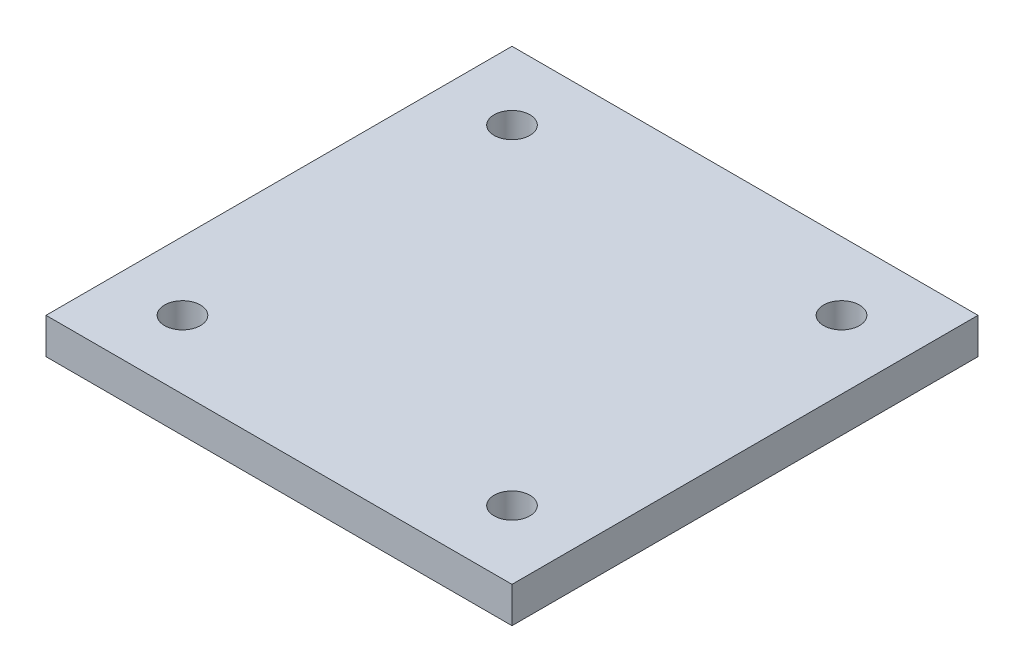
ISO-10303-21;
HEADER;
FILE_DESCRIPTION(('STEP AP214'),'2;1');
FILE_NAME('part.step','',(''),(''),'','','');
FILE_SCHEMA(('AUTOMOTIVE_DESIGN { 1 0 10303 214 1 1 1 1 }'));
ENDSEC;
DATA;
#1=APPLICATION_CONTEXT('core data for automotive mechanical design processes');
#2=APPLICATION_PROTOCOL_DEFINITION('international standard','automotive_design',2000,#1);
#3=PRODUCT_CONTEXT('',#1,'mechanical');
#4=PRODUCT('Part','Part','',(#3));
#5=PRODUCT_RELATED_PRODUCT_CATEGORY('part','',(#4));
#6=PRODUCT_DEFINITION_FORMATION('','',#4);
#7=PRODUCT_DEFINITION_CONTEXT('part definition',#1,'design');
#8=PRODUCT_DEFINITION('design','',#6,#7);
#9=PRODUCT_DEFINITION_SHAPE('','',#8);
#10=(LENGTH_UNIT() NAMED_UNIT(*) SI_UNIT(.MILLI.,.METRE.));
#11=(NAMED_UNIT(*) PLANE_ANGLE_UNIT() SI_UNIT($,.RADIAN.));
#12=(NAMED_UNIT(*) SI_UNIT($,.STERADIAN.) SOLID_ANGLE_UNIT());
#13=UNCERTAINTY_MEASURE_WITH_UNIT(LENGTH_MEASURE(1.E-05),#10,'distance_accuracy_value','');
#14=(GEOMETRIC_REPRESENTATION_CONTEXT(3) GLOBAL_UNCERTAINTY_ASSIGNED_CONTEXT((#13)) GLOBAL_UNIT_ASSIGNED_CONTEXT((#10,
#11,#12)) REPRESENTATION_CONTEXT('',''));
#15=CARTESIAN_POINT('',(0.,0.,0.));
#16=DIRECTION('',(0.,0.,1.));
#17=DIRECTION('',(1.,0.,0.));
#18=AXIS2_PLACEMENT_3D('',#15,#16,#17);
#19=CARTESIAN_POINT('',(0.,5.,0.));
#20=DIRECTION('',(0.,-1.,0.));
#21=DIRECTION('',(0.,0.,-1.));
#22=AXIS2_PLACEMENT_3D('',#19,#20,#21);
#23=PLANE('',#22);
#24=DIRECTION('',(0.,0.,-1.));
#25=VECTOR('',#24,1.);
#26=CARTESIAN_POINT('',(32.5,5.,32.5));
#27=LINE('',#26,#25);
#28=CARTESIAN_POINT('',(32.5,5.,32.5));
#29=VERTEX_POINT('',#28);
#30=CARTESIAN_POINT('',(32.5,5.,-32.5));
#31=VERTEX_POINT('',#30);
#32=EDGE_CURVE('E85',#29,#31,#27,.T.);
#33=ORIENTED_EDGE('',*,*,#32,.T.);
#34=DIRECTION('',(-1.,0.,0.));
#35=VECTOR('',#34,1.);
#36=CARTESIAN_POINT('',(-32.5,5.,-32.5));
#37=LINE('',#36,#35);
#38=CARTESIAN_POINT('',(-32.5,5.,-32.5));
#39=VERTEX_POINT('',#38);
#40=EDGE_CURVE('E80',#31,#39,#37,.T.);
#41=ORIENTED_EDGE('',*,*,#40,.T.);
#42=DIRECTION('',(0.,0.,1.));
#43=VECTOR('',#42,1.);
#44=CARTESIAN_POINT('',(-32.5,5.,32.5));
#45=LINE('',#44,#43);
#46=CARTESIAN_POINT('',(-32.5,5.,32.5));
#47=VERTEX_POINT('',#46);
#48=EDGE_CURVE('E83',#39,#47,#45,.T.);
#49=ORIENTED_EDGE('',*,*,#48,.T.);
#50=DIRECTION('',(1.,0.,0.));
#51=VECTOR('',#50,1.);
#52=CARTESIAN_POINT('',(-32.5,5.,32.5));
#53=LINE('',#52,#51);
#54=EDGE_CURVE('E50',#47,#29,#53,.T.);
#55=ORIENTED_EDGE('',*,*,#54,.T.);
#56=EDGE_LOOP('',(#33,#41,#49,#55));
#57=FACE_BOUND('',#56,.T.);
#58=CARTESIAN_POINT('',(22.9809703885628,5.,22.9809703885628));
#59=DIRECTION('',(0.,1.,0.));
#60=DIRECTION('',(0.,0.,1.));
#61=AXIS2_PLACEMENT_3D('',#58,#59,#60);
#62=CIRCLE('',#61,2.5);
#63=CARTESIAN_POINT('',(22.9809703885628,5.,25.4809703885628));
#64=VERTEX_POINT('',#63);
#65=EDGE_CURVE('E100',#64,#64,#62,.T.);
#66=ORIENTED_EDGE('',*,*,#65,.F.);
#67=EDGE_LOOP('',(#66));
#68=FACE_BOUND('',#67,.T.);
#69=CARTESIAN_POINT('',(-22.9809703885629,5.,22.9809703885627));
#70=DIRECTION('',(0.,1.,0.));
#71=DIRECTION('',(0.,0.,1.));
#72=AXIS2_PLACEMENT_3D('',#69,#70,#71);
#73=CIRCLE('',#72,2.5);
#74=CARTESIAN_POINT('',(-22.9809703885629,5.,25.4809703885627));
#75=VERTEX_POINT('',#74);
#76=EDGE_CURVE('E115',#75,#75,#73,.T.);
#77=ORIENTED_EDGE('',*,*,#76,.F.);
#78=EDGE_LOOP('',(#77));
#79=FACE_BOUND('',#78,.T.);
#80=CARTESIAN_POINT('',(-22.9809703885626,5.,-22.980970388563));
#81=DIRECTION('',(0.,1.,0.));
#82=DIRECTION('',(0.,0.,1.));
#83=AXIS2_PLACEMENT_3D('',#80,#81,#82);
#84=CIRCLE('',#83,2.5);
#85=CARTESIAN_POINT('',(-22.9809703885626,5.,-20.480970388563));
#86=VERTEX_POINT('',#85);
#87=EDGE_CURVE('E121',#86,#86,#84,.T.);
#88=ORIENTED_EDGE('',*,*,#87,.F.);
#89=EDGE_LOOP('',(#88));
#90=FACE_BOUND('',#89,.T.);
#91=CARTESIAN_POINT('',(22.980970388563,5.,-22.9809703885626));
#92=DIRECTION('',(0.,1.,0.));
#93=DIRECTION('',(0.,0.,1.));
#94=AXIS2_PLACEMENT_3D('',#91,#92,#93);
#95=CIRCLE('',#94,2.5);
#96=CARTESIAN_POINT('',(22.980970388563,5.,-20.4809703885626));
#97=VERTEX_POINT('',#96);
#98=EDGE_CURVE('E127',#97,#97,#95,.T.);
#99=ORIENTED_EDGE('',*,*,#98,.F.);
#100=EDGE_LOOP('',(#99));
#101=FACE_BOUND('',#100,.T.);
#102=ADVANCED_FACE('F33',(#57,#68,#79,#90,#101),#23,.F.);
#103=CARTESIAN_POINT('',(0.,0.,0.));
#104=DIRECTION('',(0.,-1.,0.));
#105=DIRECTION('',(0.,0.,-1.));
#106=AXIS2_PLACEMENT_3D('',#103,#104,#105);
#107=PLANE('',#106);
#108=CARTESIAN_POINT('',(-22.9809703885626,0.,-22.980970388563));
#109=DIRECTION('',(0.,1.,0.));
#110=DIRECTION('',(0.,0.,1.));
#111=AXIS2_PLACEMENT_3D('',#108,#109,#110);
#112=CIRCLE('',#111,2.5);
#113=CARTESIAN_POINT('',(-22.9809703885626,0.,-20.480970388563));
#114=VERTEX_POINT('',#113);
#115=EDGE_CURVE('E124',#114,#114,#112,.T.);
#116=ORIENTED_EDGE('',*,*,#115,.T.);
#117=EDGE_LOOP('',(#116));
#118=FACE_BOUND('',#117,.T.);
#119=CARTESIAN_POINT('',(22.9809703885628,0.,22.9809703885628));
#120=DIRECTION('',(0.,1.,0.));
#121=DIRECTION('',(0.,0.,1.));
#122=AXIS2_PLACEMENT_3D('',#119,#120,#121);
#123=CIRCLE('',#122,2.5);
#124=CARTESIAN_POINT('',(22.9809703885628,0.,25.4809703885628));
#125=VERTEX_POINT('',#124);
#126=EDGE_CURVE('E112',#125,#125,#123,.T.);
#127=ORIENTED_EDGE('',*,*,#126,.T.);
#128=EDGE_LOOP('',(#127));
#129=FACE_BOUND('',#128,.T.);
#130=DIRECTION('',(0.,0.,-1.));
#131=VECTOR('',#130,1.);
#132=CARTESIAN_POINT('',(32.5,0.,32.5));
#133=LINE('',#132,#131);
#134=CARTESIAN_POINT('',(32.5,0.,32.5));
#135=VERTEX_POINT('',#134);
#136=CARTESIAN_POINT('',(32.5,0.,-32.5));
#137=VERTEX_POINT('',#136);
#138=EDGE_CURVE('E97',#135,#137,#133,.T.);
#139=ORIENTED_EDGE('',*,*,#138,.F.);
#140=DIRECTION('',(1.,0.,0.));
#141=VECTOR('',#140,1.);
#142=CARTESIAN_POINT('',(-32.5,0.,32.5));
#143=LINE('',#142,#141);
#144=CARTESIAN_POINT('',(-32.5,0.,32.5));
#145=VERTEX_POINT('',#144);
#146=EDGE_CURVE('E73',#145,#135,#143,.T.);
#147=ORIENTED_EDGE('',*,*,#146,.F.);
#148=DIRECTION('',(0.,0.,1.));
#149=VECTOR('',#148,1.);
#150=CARTESIAN_POINT('',(-32.5,0.,32.5));
#151=LINE('',#150,#149);
#152=CARTESIAN_POINT('',(-32.5,0.,-32.5));
#153=VERTEX_POINT('',#152);
#154=EDGE_CURVE('E67',#153,#145,#151,.T.);
#155=ORIENTED_EDGE('',*,*,#154,.F.);
#156=DIRECTION('',(-1.,0.,0.));
#157=VECTOR('',#156,1.);
#158=CARTESIAN_POINT('',(-32.5,0.,-32.5));
#159=LINE('',#158,#157);
#160=EDGE_CURVE('E89',#137,#153,#159,.T.);
#161=ORIENTED_EDGE('',*,*,#160,.F.);
#162=EDGE_LOOP('',(#139,#147,#155,#161));
#163=FACE_BOUND('',#162,.T.);
#164=CARTESIAN_POINT('',(-22.9809703885629,0.,22.9809703885627));
#165=DIRECTION('',(0.,1.,0.));
#166=DIRECTION('',(0.,0.,1.));
#167=AXIS2_PLACEMENT_3D('',#164,#165,#166);
#168=CIRCLE('',#167,2.5);
#169=CARTESIAN_POINT('',(-22.9809703885629,0.,25.4809703885627));
#170=VERTEX_POINT('',#169);
#171=EDGE_CURVE('E118',#170,#170,#168,.T.);
#172=ORIENTED_EDGE('',*,*,#171,.T.);
#173=EDGE_LOOP('',(#172));
#174=FACE_BOUND('',#173,.T.);
#175=CARTESIAN_POINT('',(22.980970388563,0.,-22.9809703885626));
#176=DIRECTION('',(0.,1.,0.));
#177=DIRECTION('',(0.,0.,1.));
#178=AXIS2_PLACEMENT_3D('',#175,#176,#177);
#179=CIRCLE('',#178,2.5);
#180=CARTESIAN_POINT('',(22.980970388563,0.,-20.4809703885626));
#181=VERTEX_POINT('',#180);
#182=EDGE_CURVE('E130',#181,#181,#179,.T.);
#183=ORIENTED_EDGE('',*,*,#182,.T.);
#184=EDGE_LOOP('',(#183));
#185=FACE_BOUND('',#184,.T.);
#186=ADVANCED_FACE('F108',(#118,#129,#163,#174,#185),#107,.T.);
#187=CARTESIAN_POINT('',(32.5,5.,32.5));
#188=DIRECTION('',(-1.,0.,0.));
#189=DIRECTION('',(0.,0.,1.));
#190=AXIS2_PLACEMENT_3D('',#187,#188,#189);
#191=PLANE('',#190);
#192=ORIENTED_EDGE('',*,*,#138,.T.);
#193=DIRECTION('',(0.,-1.,0.));
#194=VECTOR('',#193,1.);
#195=CARTESIAN_POINT('',(32.5,5.,-32.5));
#196=LINE('',#195,#194);
#197=EDGE_CURVE('E11',#31,#137,#196,.T.);
#198=ORIENTED_EDGE('',*,*,#197,.F.);
#199=ORIENTED_EDGE('',*,*,#32,.F.);
#200=DIRECTION('',(0.,-1.,0.));
#201=VECTOR('',#200,1.);
#202=CARTESIAN_POINT('',(32.5,5.,32.5));
#203=LINE('',#202,#201);
#204=EDGE_CURVE('E93',#29,#135,#203,.T.);
#205=ORIENTED_EDGE('',*,*,#204,.T.);
#206=EDGE_LOOP('',(#192,#198,#199,#205));
#207=FACE_BOUND('',#206,.T.);
#208=ADVANCED_FACE('F35',(#207),#191,.F.);
#209=CARTESIAN_POINT('',(-32.5,5.,-32.5));
#210=DIRECTION('',(0.,0.,1.));
#211=DIRECTION('',(1.,0.,0.));
#212=AXIS2_PLACEMENT_3D('',#209,#210,#211);
#213=PLANE('',#212);
#214=ORIENTED_EDGE('',*,*,#160,.T.);
#215=DIRECTION('',(0.,-1.,0.));
#216=VECTOR('',#215,1.);
#217=CARTESIAN_POINT('',(-32.5,5.,-32.5));
#218=LINE('',#217,#216);
#219=EDGE_CURVE('E42',#39,#153,#218,.T.);
#220=ORIENTED_EDGE('',*,*,#219,.F.);
#221=ORIENTED_EDGE('',*,*,#40,.F.);
#222=ORIENTED_EDGE('',*,*,#197,.T.);
#223=EDGE_LOOP('',(#214,#220,#221,#222));
#224=FACE_BOUND('',#223,.T.);
#225=ADVANCED_FACE('F88',(#224),#213,.F.);
#226=CARTESIAN_POINT('',(-32.5,5.,32.5));
#227=DIRECTION('',(1.,0.,0.));
#228=DIRECTION('',(0.,0.,-1.));
#229=AXIS2_PLACEMENT_3D('',#226,#227,#228);
#230=PLANE('',#229);
#231=ORIENTED_EDGE('',*,*,#154,.T.);
#232=DIRECTION('',(0.,-1.,0.));
#233=VECTOR('',#232,1.);
#234=CARTESIAN_POINT('',(-32.5,5.,32.5));
#235=LINE('',#234,#233);
#236=EDGE_CURVE('E90',#47,#145,#235,.T.);
#237=ORIENTED_EDGE('',*,*,#236,.F.);
#238=ORIENTED_EDGE('',*,*,#48,.F.);
#239=ORIENTED_EDGE('',*,*,#219,.T.);
#240=EDGE_LOOP('',(#231,#237,#238,#239));
#241=FACE_BOUND('',#240,.T.);
#242=ADVANCED_FACE('F91',(#241),#230,.F.);
#243=CARTESIAN_POINT('',(-32.5,5.,32.5));
#244=DIRECTION('',(0.,0.,-1.));
#245=DIRECTION('',(-1.,0.,0.));
#246=AXIS2_PLACEMENT_3D('',#243,#244,#245);
#247=PLANE('',#246);
#248=ORIENTED_EDGE('',*,*,#146,.T.);
#249=ORIENTED_EDGE('',*,*,#204,.F.);
#250=ORIENTED_EDGE('',*,*,#54,.F.);
#251=ORIENTED_EDGE('',*,*,#236,.T.);
#252=EDGE_LOOP('',(#248,#249,#250,#251));
#253=FACE_BOUND('',#252,.T.);
#254=ADVANCED_FACE('F105',(#253),#247,.F.);
#255=CARTESIAN_POINT('',(22.9809703885628,5.,22.9809703885628));
#256=DIRECTION('',(0.,-1.,0.));
#257=DIRECTION('',(0.,0.,-1.));
#258=AXIS2_PLACEMENT_3D('',#255,#256,#257);
#259=CYLINDRICAL_SURFACE('',#258,2.5);
#260=ORIENTED_EDGE('',*,*,#65,.T.);
#261=EDGE_LOOP('',(#260));
#262=FACE_BOUND('',#261,.T.);
#263=ORIENTED_EDGE('',*,*,#126,.F.);
#264=EDGE_LOOP('',(#263));
#265=FACE_BOUND('',#264,.T.);
#266=ADVANCED_FACE('F147',(#262,#265),#259,.F.);
#267=CARTESIAN_POINT('',(-22.9809703885629,5.,22.9809703885627));
#268=DIRECTION('',(0.,-1.,0.));
#269=DIRECTION('',(0.,0.,-1.));
#270=AXIS2_PLACEMENT_3D('',#267,#268,#269);
#271=CYLINDRICAL_SURFACE('',#270,2.5);
#272=ORIENTED_EDGE('',*,*,#76,.T.);
#273=EDGE_LOOP('',(#272));
#274=FACE_BOUND('',#273,.T.);
#275=ORIENTED_EDGE('',*,*,#171,.F.);
#276=EDGE_LOOP('',(#275));
#277=FACE_BOUND('',#276,.T.);
#278=ADVANCED_FACE('F193',(#274,#277),#271,.F.);
#279=CARTESIAN_POINT('',(-22.9809703885626,5.,-22.980970388563));
#280=DIRECTION('',(0.,-1.,0.));
#281=DIRECTION('',(0.,0.,-1.));
#282=AXIS2_PLACEMENT_3D('',#279,#280,#281);
#283=CYLINDRICAL_SURFACE('',#282,2.5);
#284=ORIENTED_EDGE('',*,*,#87,.T.);
#285=EDGE_LOOP('',(#284));
#286=FACE_BOUND('',#285,.T.);
#287=ORIENTED_EDGE('',*,*,#115,.F.);
#288=EDGE_LOOP('',(#287));
#289=FACE_BOUND('',#288,.T.);
#290=ADVANCED_FACE('F201',(#286,#289),#283,.F.);
#291=CARTESIAN_POINT('',(22.980970388563,5.,-22.9809703885626));
#292=DIRECTION('',(0.,-1.,0.));
#293=DIRECTION('',(0.,0.,-1.));
#294=AXIS2_PLACEMENT_3D('',#291,#292,#293);
#295=CYLINDRICAL_SURFACE('',#294,2.5);
#296=ORIENTED_EDGE('',*,*,#98,.T.);
#297=EDGE_LOOP('',(#296));
#298=FACE_BOUND('',#297,.T.);
#299=ORIENTED_EDGE('',*,*,#182,.F.);
#300=EDGE_LOOP('',(#299));
#301=FACE_BOUND('',#300,.T.);
#302=ADVANCED_FACE('F136',(#298,#301),#295,.F.);
#303=CLOSED_SHELL('',(#102,#186,#208,#225,#242,#254,#266,#278,#290,#302));
#304=MANIFOLD_SOLID_BREP('B2',#303);
#305=ADVANCED_BREP_SHAPE_REPRESENTATION('',(#18,#304),#14);
#306=SHAPE_DEFINITION_REPRESENTATION(#9,#305);
ENDSEC;
END-ISO-10303-21;
